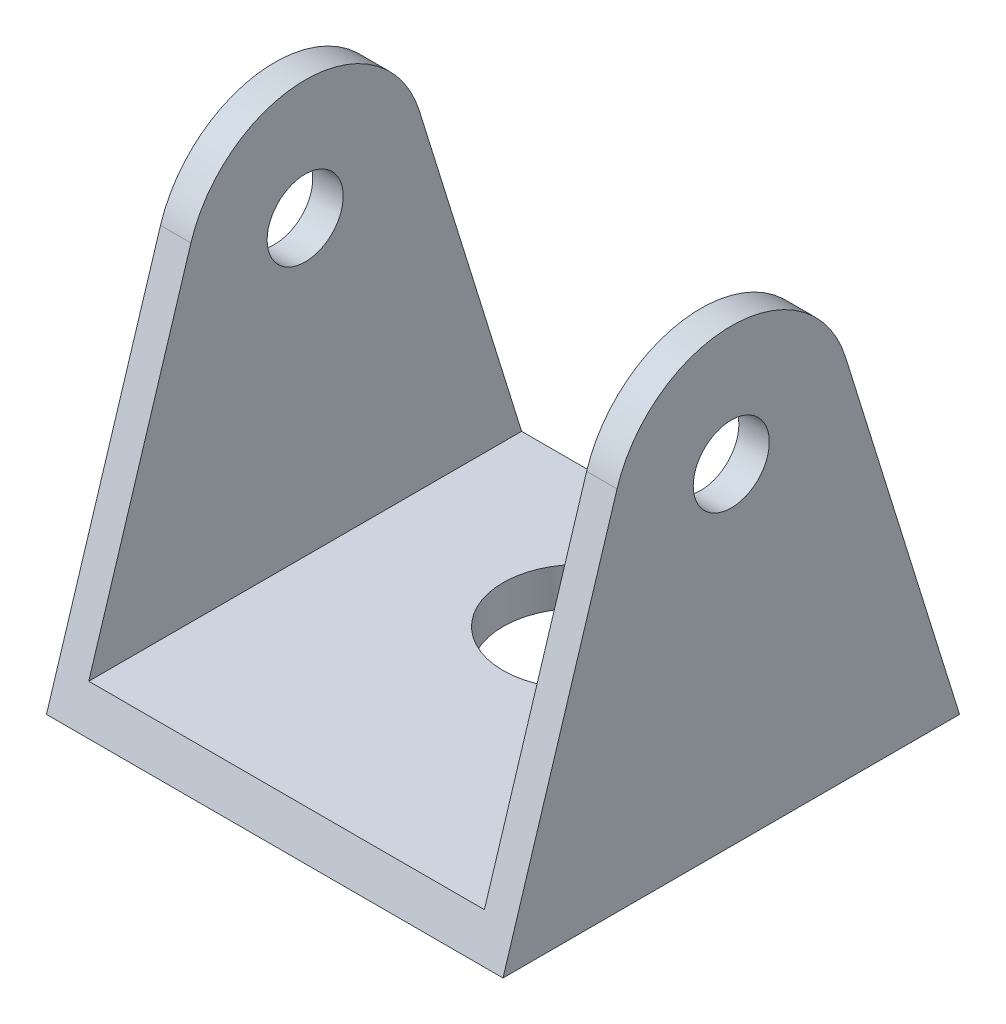
ISO-10303-21;
HEADER;
FILE_DESCRIPTION(('STEP AP214'),'2;1');
FILE_NAME('part.step','',(''),(''),'','','');
FILE_SCHEMA(('AUTOMOTIVE_DESIGN { 1 0 10303 214 1 1 1 1 }'));
ENDSEC;
DATA;
#1=APPLICATION_CONTEXT('core data for automotive mechanical design processes');
#2=APPLICATION_PROTOCOL_DEFINITION('international standard','automotive_design',2000,#1);
#3=PRODUCT_CONTEXT('',#1,'mechanical');
#4=PRODUCT('Part','Part','',(#3));
#5=PRODUCT_RELATED_PRODUCT_CATEGORY('part','',(#4));
#6=PRODUCT_DEFINITION_FORMATION('','',#4);
#7=PRODUCT_DEFINITION_CONTEXT('part definition',#1,'design');
#8=PRODUCT_DEFINITION('design','',#6,#7);
#9=PRODUCT_DEFINITION_SHAPE('','',#8);
#10=(LENGTH_UNIT() NAMED_UNIT(*) SI_UNIT(.MILLI.,.METRE.));
#11=(NAMED_UNIT(*) PLANE_ANGLE_UNIT() SI_UNIT($,.RADIAN.));
#12=(NAMED_UNIT(*) SI_UNIT($,.STERADIAN.) SOLID_ANGLE_UNIT());
#13=UNCERTAINTY_MEASURE_WITH_UNIT(LENGTH_MEASURE(1.E-05),#10,'distance_accuracy_value','');
#14=(GEOMETRIC_REPRESENTATION_CONTEXT(3) GLOBAL_UNCERTAINTY_ASSIGNED_CONTEXT((#13)) GLOBAL_UNIT_ASSIGNED_CONTEXT((#10,
#11,#12)) REPRESENTATION_CONTEXT('',''));
#15=CARTESIAN_POINT('',(0.,0.,0.));
#16=DIRECTION('',(0.,0.,1.));
#17=DIRECTION('',(1.,0.,0.));
#18=AXIS2_PLACEMENT_3D('',#15,#16,#17);
#19=CARTESIAN_POINT('',(0.,2.5,0.));
#20=DIRECTION('',(0.,1.,0.));
#21=DIRECTION('',(0.,0.,1.));
#22=AXIS2_PLACEMENT_3D('',#19,#20,#21);
#23=PLANE('',#22);
#24=DIRECTION('',(-1.,0.,0.));
#25=VECTOR('',#24,1.);
#26=CARTESIAN_POINT('',(0.,2.5,14.2221337816421));
#27=LINE('',#26,#25);
#28=CARTESIAN_POINT('',(13.,2.5,14.2221337816421));
#29=VERTEX_POINT('',#28);
#30=CARTESIAN_POINT('',(-13.,2.5,14.2221337816421));
#31=VERTEX_POINT('',#30);
#32=EDGE_CURVE('E169',#29,#31,#27,.T.);
#33=ORIENTED_EDGE('',*,*,#32,.F.);
#34=DIRECTION('',(0.,0.,1.));
#35=VECTOR('',#34,1.);
#36=CARTESIAN_POINT('',(13.,2.5,-15.));
#37=LINE('',#36,#35);
#38=CARTESIAN_POINT('',(13.,2.49999999999999,-14.2221337816421));
#39=VERTEX_POINT('',#38);
#40=EDGE_CURVE('E182',#39,#29,#37,.T.);
#41=ORIENTED_EDGE('',*,*,#40,.F.);
#42=DIRECTION('',(1.,0.,0.));
#43=VECTOR('',#42,1.);
#44=CARTESIAN_POINT('',(0.,2.5,-14.2221337816421));
#45=LINE('',#44,#43);
#46=CARTESIAN_POINT('',(-13.,2.5,-14.2221337816421));
#47=VERTEX_POINT('',#46);
#48=EDGE_CURVE('E48',#47,#39,#45,.T.);
#49=ORIENTED_EDGE('',*,*,#48,.F.);
#50=DIRECTION('',(0.,0.,-1.));
#51=VECTOR('',#50,1.);
#52=CARTESIAN_POINT('',(-13.,2.5,-15.));
#53=LINE('',#52,#51);
#54=EDGE_CURVE('E184',#31,#47,#53,.T.);
#55=ORIENTED_EDGE('',*,*,#54,.F.);
#56=EDGE_LOOP('',(#33,#41,#49,#55));
#57=FACE_BOUND('',#56,.T.);
#58=CARTESIAN_POINT('',(0.,2.5,-5.));
#59=DIRECTION('',(0.,1.,0.));
#60=DIRECTION('',(0.,0.,1.));
#61=AXIS2_PLACEMENT_3D('',#58,#59,#60);
#62=CIRCLE('',#61,5.);
#63=CARTESIAN_POINT('',(0.,2.5,0.));
#64=VERTEX_POINT('',#63);
#65=EDGE_CURVE('E123',#64,#64,#62,.T.);
#66=ORIENTED_EDGE('',*,*,#65,.F.);
#67=EDGE_LOOP('',(#66));
#68=FACE_BOUND('',#67,.T.);
#69=ADVANCED_FACE('F33',(#57,#68),#23,.T.);
#70=CARTESIAN_POINT('',(-15.,2.5,15.));
#71=DIRECTION('',(1.,0.,0.));
#72=DIRECTION('',(0.,0.,-1.));
#73=AXIS2_PLACEMENT_3D('',#70,#71,#72);
#74=PLANE('',#73);
#75=CARTESIAN_POINT('',(-15.,21.75,0.));
#76=DIRECTION('',(-1.,0.,0.));
#77=DIRECTION('',(0.,0.,1.));
#78=AXIS2_PLACEMENT_3D('',#75,#76,#77);
#79=CIRCLE('',#78,2.5);
#80=CARTESIAN_POINT('',(-15.,21.75,2.5));
#81=VERTEX_POINT('',#80);
#82=EDGE_CURVE('E132',#81,#81,#79,.T.);
#83=ORIENTED_EDGE('',*,*,#82,.F.);
#84=EDGE_LOOP('',(#83));
#85=FACE_BOUND('',#84,.T.);
#86=DIRECTION('',(0.,0.,1.));
#87=VECTOR('',#86,1.);
#88=CARTESIAN_POINT('',(-15.,0.,15.));
#89=LINE('',#88,#87);
#90=CARTESIAN_POINT('',(-15.,0.,-15.));
#91=VERTEX_POINT('',#90);
#92=CARTESIAN_POINT('',(-15.,0.,15.));
#93=VERTEX_POINT('',#92);
#94=EDGE_CURVE('E112',#91,#93,#89,.T.);
#95=ORIENTED_EDGE('',*,*,#94,.T.);
#96=DIRECTION('',(0.,-0.954847194247238,0.297097350439511));
#97=VECTOR('',#96,1.);
#98=CARTESIAN_POINT('',(-15.,0.,15.));
#99=LINE('',#98,#97);
#100=CARTESIAN_POINT('',(-15.,24.0854348971515,7.50590153561869));
#101=VERTEX_POINT('',#100);
#102=EDGE_CURVE('E157',#101,#93,#99,.T.);
#103=ORIENTED_EDGE('',*,*,#102,.F.);
#104=CARTESIAN_POINT('',(-15.,21.75,0.));
#105=DIRECTION('',(1.,0.,0.));
#106=DIRECTION('',(0.,0.,1.));
#107=AXIS2_PLACEMENT_3D('',#104,#105,#106);
#108=CIRCLE('',#107,7.86084054164921);
#109=CARTESIAN_POINT('',(-15.,24.0854348971515,-7.50590153561869));
#110=VERTEX_POINT('',#109);
#111=EDGE_CURVE('E114',#110,#101,#108,.T.);
#112=ORIENTED_EDGE('',*,*,#111,.F.);
#113=DIRECTION('',(0.,0.954847194247238,0.297097350439511));
#114=VECTOR('',#113,1.);
#115=CARTESIAN_POINT('',(-15.,0.,-15.));
#116=LINE('',#115,#114);
#117=EDGE_CURVE('E101',#91,#110,#116,.T.);
#118=ORIENTED_EDGE('',*,*,#117,.F.);
#119=EDGE_LOOP('',(#95,#103,#112,#118));
#120=FACE_BOUND('',#119,.T.);
#121=ADVANCED_FACE('F35',(#85,#120),#74,.F.);
#122=CARTESIAN_POINT('',(15.,2.5,15.));
#123=DIRECTION('',(-1.,0.,0.));
#124=DIRECTION('',(0.,0.,1.));
#125=AXIS2_PLACEMENT_3D('',#122,#123,#124);
#126=PLANE('',#125);
#127=CARTESIAN_POINT('',(15.,21.75,0.));
#128=DIRECTION('',(-1.,0.,0.));
#129=DIRECTION('',(0.,0.,1.));
#130=AXIS2_PLACEMENT_3D('',#127,#128,#129);
#131=CIRCLE('',#130,2.5);
#132=CARTESIAN_POINT('',(15.,21.75,2.5));
#133=VERTEX_POINT('',#132);
#134=EDGE_CURVE('E179',#133,#133,#131,.T.);
#135=ORIENTED_EDGE('',*,*,#134,.T.);
#136=EDGE_LOOP('',(#135));
#137=FACE_BOUND('',#136,.T.);
#138=CARTESIAN_POINT('',(15.,21.75,0.));
#139=DIRECTION('',(-1.,0.,0.));
#140=DIRECTION('',(0.,0.,1.));
#141=AXIS2_PLACEMENT_3D('',#138,#139,#140);
#142=CIRCLE('',#141,7.86084054164921);
#143=CARTESIAN_POINT('',(15.,24.0854348971515,-7.50590153561869));
#144=VERTEX_POINT('',#143);
#145=CARTESIAN_POINT('',(15.,24.0854348971515,7.50590153561869));
#146=VERTEX_POINT('',#145);
#147=EDGE_CURVE('E167',#144,#146,#142,.F.);
#148=ORIENTED_EDGE('',*,*,#147,.T.);
#149=DIRECTION('',(0.,-0.954847194247238,0.297097350439511));
#150=VECTOR('',#149,1.);
#151=CARTESIAN_POINT('',(15.,2.27933291090456,14.2907935712864));
#152=LINE('',#151,#150);
#153=CARTESIAN_POINT('',(15.,0.,15.));
#154=VERTEX_POINT('',#153);
#155=EDGE_CURVE('E150',#146,#154,#152,.T.);
#156=ORIENTED_EDGE('',*,*,#155,.T.);
#157=DIRECTION('',(0.,0.,-1.));
#158=VECTOR('',#157,1.);
#159=CARTESIAN_POINT('',(15.,0.,15.));
#160=LINE('',#159,#158);
#161=CARTESIAN_POINT('',(15.,0.,-15.));
#162=VERTEX_POINT('',#161);
#163=EDGE_CURVE('E107',#154,#162,#160,.T.);
#164=ORIENTED_EDGE('',*,*,#163,.T.);
#165=DIRECTION('',(0.,0.954847194247238,0.297097350439511));
#166=VECTOR('',#165,1.);
#167=CARTESIAN_POINT('',(15.,10.7898100554682,-11.642788502141));
#168=LINE('',#167,#166);
#169=EDGE_CURVE('E55',#162,#144,#168,.T.);
#170=ORIENTED_EDGE('',*,*,#169,.T.);
#171=EDGE_LOOP('',(#148,#156,#164,#170));
#172=FACE_BOUND('',#171,.T.);
#173=ADVANCED_FACE('F199',(#137,#172),#126,.F.);
#174=CARTESIAN_POINT('',(0.,0.,0.));
#175=DIRECTION('',(0.,1.,0.));
#176=DIRECTION('',(0.,0.,1.));
#177=AXIS2_PLACEMENT_3D('',#174,#175,#176);
#178=PLANE('',#177);
#179=CARTESIAN_POINT('',(0.,0.,-5.));
#180=DIRECTION('',(0.,1.,0.));
#181=DIRECTION('',(0.,0.,1.));
#182=AXIS2_PLACEMENT_3D('',#179,#180,#181);
#183=CIRCLE('',#182,5.);
#184=CARTESIAN_POINT('',(0.,0.,0.));
#185=VERTEX_POINT('',#184);
#186=EDGE_CURVE('E119',#185,#185,#183,.T.);
#187=ORIENTED_EDGE('',*,*,#186,.T.);
#188=EDGE_LOOP('',(#187));
#189=FACE_BOUND('',#188,.T.);
#190=ORIENTED_EDGE('',*,*,#94,.F.);
#191=DIRECTION('',(-1.,0.,0.));
#192=VECTOR('',#191,1.);
#193=CARTESIAN_POINT('',(15.,0.,-15.));
#194=LINE('',#193,#192);
#195=EDGE_CURVE('E97',#162,#91,#194,.T.);
#196=ORIENTED_EDGE('',*,*,#195,.F.);
#197=ORIENTED_EDGE('',*,*,#163,.F.);
#198=DIRECTION('',(1.,0.,0.));
#199=VECTOR('',#198,1.);
#200=CARTESIAN_POINT('',(15.,0.,15.));
#201=LINE('',#200,#199);
#202=EDGE_CURVE('E118',#93,#154,#201,.T.);
#203=ORIENTED_EDGE('',*,*,#202,.F.);
#204=EDGE_LOOP('',(#190,#196,#197,#203));
#205=FACE_BOUND('',#204,.T.);
#206=ADVANCED_FACE('F117',(#189,#205),#178,.F.);
#207=CARTESIAN_POINT('',(0.,0.,-5.));
#208=DIRECTION('',(0.,1.,0.));
#209=DIRECTION('',(0.,0.,1.));
#210=AXIS2_PLACEMENT_3D('',#207,#208,#209);
#211=CYLINDRICAL_SURFACE('',#210,5.);
#212=ORIENTED_EDGE('',*,*,#186,.F.);
#213=EDGE_LOOP('',(#212));
#214=FACE_BOUND('',#213,.T.);
#215=ORIENTED_EDGE('',*,*,#65,.T.);
#216=EDGE_LOOP('',(#215));
#217=FACE_BOUND('',#216,.T.);
#218=ADVANCED_FACE('F191',(#214,#217),#211,.F.);
#219=CARTESIAN_POINT('',(-13.,34.25,-15.));
#220=DIRECTION('',(-1.,0.,0.));
#221=DIRECTION('',(0.,0.,1.));
#222=AXIS2_PLACEMENT_3D('',#219,#220,#221);
#223=PLANE('',#222);
#224=CARTESIAN_POINT('',(-13.,21.75,0.));
#225=DIRECTION('',(-1.,0.,0.));
#226=DIRECTION('',(0.,0.,1.));
#227=AXIS2_PLACEMENT_3D('',#224,#225,#226);
#228=CIRCLE('',#227,2.5);
#229=CARTESIAN_POINT('',(-13.,21.75,2.5));
#230=VERTEX_POINT('',#229);
#231=EDGE_CURVE('E131',#230,#230,#228,.T.);
#232=ORIENTED_EDGE('',*,*,#231,.T.);
#233=EDGE_LOOP('',(#232));
#234=FACE_BOUND('',#233,.T.);
#235=CARTESIAN_POINT('',(-13.,21.75,0.));
#236=DIRECTION('',(-1.,0.,0.));
#237=DIRECTION('',(0.,0.,1.));
#238=AXIS2_PLACEMENT_3D('',#235,#236,#237);
#239=CIRCLE('',#238,7.86084054164921);
#240=CARTESIAN_POINT('',(-13.,24.0854348971515,-7.50590153561869));
#241=VERTEX_POINT('',#240);
#242=CARTESIAN_POINT('',(-13.,24.0854348971515,7.50590153561869));
#243=VERTEX_POINT('',#242);
#244=EDGE_CURVE('E164',#241,#243,#239,.F.);
#245=ORIENTED_EDGE('',*,*,#244,.T.);
#246=DIRECTION('',(0.,-0.954847194247238,0.297097350439511));
#247=VECTOR('',#246,1.);
#248=CARTESIAN_POINT('',(-13.,39.7373380239561,2.63586685747784));
#249=LINE('',#248,#247);
#250=EDGE_CURVE('E171',#243,#31,#249,.T.);
#251=ORIENTED_EDGE('',*,*,#250,.T.);
#252=ORIENTED_EDGE('',*,*,#54,.T.);
#253=DIRECTION('',(0.,0.954847194247238,0.297097350439511));
#254=VECTOR('',#253,1.);
#255=CARTESIAN_POINT('',(-13.,31.2268608793924,-5.28387192662316));
#256=LINE('',#255,#254);
#257=EDGE_CURVE('E153',#47,#241,#256,.T.);
#258=ORIENTED_EDGE('',*,*,#257,.T.);
#259=EDGE_LOOP('',(#245,#251,#252,#258));
#260=FACE_BOUND('',#259,.T.);
#261=ADVANCED_FACE('F223',(#234,#260),#223,.F.);
#262=CARTESIAN_POINT('',(13.,34.25,-15.));
#263=DIRECTION('',(1.,0.,0.));
#264=DIRECTION('',(0.,0.,-1.));
#265=AXIS2_PLACEMENT_3D('',#262,#263,#264);
#266=PLANE('',#265);
#267=CARTESIAN_POINT('',(13.,21.75,0.));
#268=DIRECTION('',(1.,0.,0.));
#269=DIRECTION('',(0.,0.,-1.));
#270=AXIS2_PLACEMENT_3D('',#267,#268,#269);
#271=CIRCLE('',#270,2.5);
#272=CARTESIAN_POINT('',(13.,21.75,-2.5));
#273=VERTEX_POINT('',#272);
#274=EDGE_CURVE('E128',#273,#273,#271,.T.);
#275=ORIENTED_EDGE('',*,*,#274,.T.);
#276=EDGE_LOOP('',(#275));
#277=FACE_BOUND('',#276,.T.);
#278=ORIENTED_EDGE('',*,*,#40,.T.);
#279=DIRECTION('',(0.,0.954847194247238,-0.297097350439511));
#280=VECTOR('',#279,1.);
#281=CARTESIAN_POINT('',(13.,39.7373380239561,2.63586685747784));
#282=LINE('',#281,#280);
#283=CARTESIAN_POINT('',(13.,24.0854348971515,7.50590153561869));
#284=VERTEX_POINT('',#283);
#285=EDGE_CURVE('E11',#29,#284,#282,.T.);
#286=ORIENTED_EDGE('',*,*,#285,.T.);
#287=CARTESIAN_POINT('',(13.,21.75,0.));
#288=DIRECTION('',(1.,0.,0.));
#289=DIRECTION('',(0.,0.,-1.));
#290=AXIS2_PLACEMENT_3D('',#287,#288,#289);
#291=CIRCLE('',#290,7.86084054164921);
#292=CARTESIAN_POINT('',(13.,24.0854348971515,-7.50590153561869));
#293=VERTEX_POINT('',#292);
#294=EDGE_CURVE('E41',#284,#293,#291,.F.);
#295=ORIENTED_EDGE('',*,*,#294,.T.);
#296=DIRECTION('',(0.,-0.954847194247238,-0.297097350439511));
#297=VECTOR('',#296,1.);
#298=CARTESIAN_POINT('',(13.,31.2268608793924,-5.28387192662316));
#299=LINE('',#298,#297);
#300=EDGE_CURVE('E106',#293,#39,#299,.T.);
#301=ORIENTED_EDGE('',*,*,#300,.T.);
#302=EDGE_LOOP('',(#278,#286,#295,#301));
#303=FACE_BOUND('',#302,.T.);
#304=ADVANCED_FACE('F136',(#277,#303),#266,.F.);
#305=CARTESIAN_POINT('',(15.75,21.75,0.));
#306=DIRECTION('',(-1.,0.,0.));
#307=DIRECTION('',(0.,0.,1.));
#308=AXIS2_PLACEMENT_3D('',#305,#306,#307);
#309=CYLINDRICAL_SURFACE('',#308,2.5);
#310=ORIENTED_EDGE('',*,*,#274,.F.);
#311=EDGE_LOOP('',(#310));
#312=FACE_BOUND('',#311,.T.);
#313=ORIENTED_EDGE('',*,*,#134,.F.);
#314=EDGE_LOOP('',(#313));
#315=FACE_BOUND('',#314,.T.);
#316=ADVANCED_FACE('F213',(#312,#315),#309,.F.);
#317=ORIENTED_EDGE('',*,*,#82,.T.);
#318=EDGE_LOOP('',(#317));
#319=FACE_BOUND('',#318,.T.);
#320=ORIENTED_EDGE('',*,*,#231,.F.);
#321=EDGE_LOOP('',(#320));
#322=FACE_BOUND('',#321,.T.);
#323=ADVANCED_FACE('F215',(#319,#322),#309,.F.);
#324=CARTESIAN_POINT('',(15.75,0.,15.));
#325=DIRECTION('',(0.,-0.297097350439511,-0.954847194247238));
#326=DIRECTION('',(0.,0.954847194247238,-0.297097350439511));
#327=AXIS2_PLACEMENT_3D('',#324,#325,#326);
#328=PLANE('',#327);
#329=DIRECTION('',(-1.,0.,0.));
#330=VECTOR('',#329,1.);
#331=CARTESIAN_POINT('',(15.75,24.0854348971515,7.50590153561869));
#332=LINE('',#331,#330);
#333=EDGE_CURVE('E143',#146,#284,#332,.T.);
#334=ORIENTED_EDGE('',*,*,#333,.T.);
#335=ORIENTED_EDGE('',*,*,#285,.F.);
#336=ORIENTED_EDGE('',*,*,#32,.T.);
#337=ORIENTED_EDGE('',*,*,#250,.F.);
#338=EDGE_CURVE('E151',#243,#101,#332,.T.);
#339=ORIENTED_EDGE('',*,*,#338,.T.);
#340=ORIENTED_EDGE('',*,*,#102,.T.);
#341=ORIENTED_EDGE('',*,*,#202,.T.);
#342=ORIENTED_EDGE('',*,*,#155,.F.);
#343=EDGE_LOOP('',(#334,#335,#336,#337,#339,#340,#341,#342));
#344=FACE_BOUND('',#343,.T.);
#345=ADVANCED_FACE('F147',(#344),#328,.F.);
#346=CARTESIAN_POINT('',(15.75,21.75,0.));
#347=DIRECTION('',(-1.,0.,0.));
#348=DIRECTION('',(0.,0.,1.));
#349=AXIS2_PLACEMENT_3D('',#346,#347,#348);
#350=CYLINDRICAL_SURFACE('',#349,7.86084054164921);
#351=DIRECTION('',(-1.,0.,0.));
#352=VECTOR('',#351,1.);
#353=CARTESIAN_POINT('',(15.75,24.0854348971515,-7.50590153561869));
#354=LINE('',#353,#352);
#355=EDGE_CURVE('E145',#144,#293,#354,.T.);
#356=ORIENTED_EDGE('',*,*,#355,.T.);
#357=ORIENTED_EDGE('',*,*,#294,.F.);
#358=ORIENTED_EDGE('',*,*,#333,.F.);
#359=ORIENTED_EDGE('',*,*,#147,.F.);
#360=EDGE_LOOP('',(#356,#357,#358,#359));
#361=FACE_BOUND('',#360,.T.);
#362=ADVANCED_FACE('F142',(#361),#350,.T.);
#363=EDGE_CURVE('E159',#241,#110,#354,.T.);
#364=ORIENTED_EDGE('',*,*,#363,.T.);
#365=ORIENTED_EDGE('',*,*,#111,.T.);
#366=ORIENTED_EDGE('',*,*,#338,.F.);
#367=ORIENTED_EDGE('',*,*,#244,.F.);
#368=EDGE_LOOP('',(#364,#365,#366,#367));
#369=FACE_BOUND('',#368,.T.);
#370=ADVANCED_FACE('F238',(#369),#350,.T.);
#371=CARTESIAN_POINT('',(15.75,0.,-15.));
#372=DIRECTION('',(0.,-0.297097350439511,0.954847194247238));
#373=DIRECTION('',(0.,-0.954847194247238,-0.297097350439511));
#374=AXIS2_PLACEMENT_3D('',#371,#372,#373);
#375=PLANE('',#374);
#376=ORIENTED_EDGE('',*,*,#195,.T.);
#377=ORIENTED_EDGE('',*,*,#117,.T.);
#378=ORIENTED_EDGE('',*,*,#363,.F.);
#379=ORIENTED_EDGE('',*,*,#257,.F.);
#380=ORIENTED_EDGE('',*,*,#48,.T.);
#381=ORIENTED_EDGE('',*,*,#300,.F.);
#382=ORIENTED_EDGE('',*,*,#355,.F.);
#383=ORIENTED_EDGE('',*,*,#169,.F.);
#384=EDGE_LOOP('',(#376,#377,#378,#379,#380,#381,#382,#383));
#385=FACE_BOUND('',#384,.T.);
#386=ADVANCED_FACE('F99',(#385),#375,.F.);
#387=CLOSED_SHELL('',(#69,#121,#173,#206,#218,#261,#304,#316,#323,#345,#362,#370,#386));
#388=MANIFOLD_SOLID_BREP('B2',#387);
#389=ADVANCED_BREP_SHAPE_REPRESENTATION('',(#18,#388),#14);
#390=SHAPE_DEFINITION_REPRESENTATION(#9,#389);
ENDSEC;
END-ISO-10303-21;
